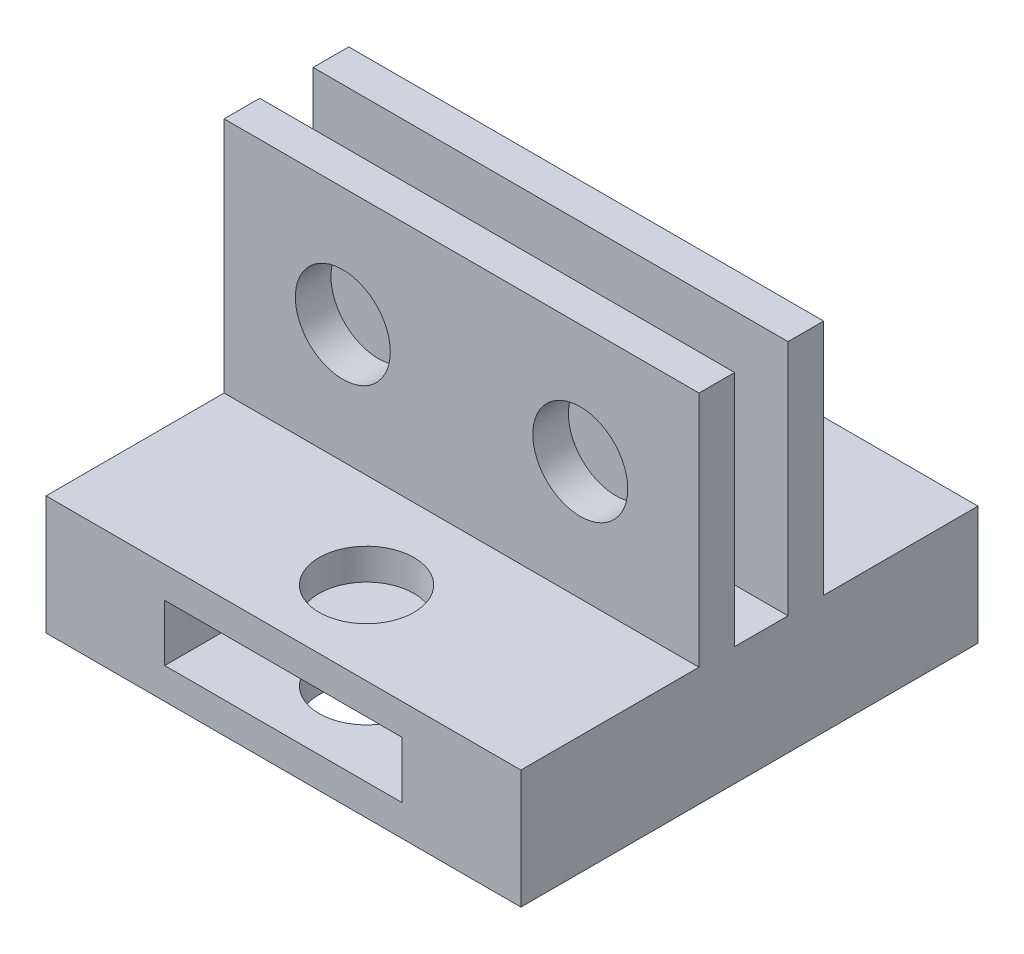
ISO-10303-21;
HEADER;
FILE_DESCRIPTION(('STEP AP214'),'2;1');
FILE_NAME('part.step','',(''),(''),'','','');
FILE_SCHEMA(('AUTOMOTIVE_DESIGN { 1 0 10303 214 1 1 1 1 }'));
ENDSEC;
DATA;
#1=APPLICATION_CONTEXT('core data for automotive mechanical design processes');
#2=APPLICATION_PROTOCOL_DEFINITION('international standard','automotive_design',2000,#1);
#3=PRODUCT_CONTEXT('',#1,'mechanical');
#4=PRODUCT('Part','Part','',(#3));
#5=PRODUCT_RELATED_PRODUCT_CATEGORY('part','',(#4));
#6=PRODUCT_DEFINITION_FORMATION('','',#4);
#7=PRODUCT_DEFINITION_CONTEXT('part definition',#1,'design');
#8=PRODUCT_DEFINITION('design','',#6,#7);
#9=PRODUCT_DEFINITION_SHAPE('','',#8);
#10=(LENGTH_UNIT() NAMED_UNIT(*) SI_UNIT(.MILLI.,.METRE.));
#11=(NAMED_UNIT(*) PLANE_ANGLE_UNIT() SI_UNIT($,.RADIAN.));
#12=(NAMED_UNIT(*) SI_UNIT($,.STERADIAN.) SOLID_ANGLE_UNIT());
#13=UNCERTAINTY_MEASURE_WITH_UNIT(LENGTH_MEASURE(1.E-05),#10,'distance_accuracy_value','');
#14=(GEOMETRIC_REPRESENTATION_CONTEXT(3) GLOBAL_UNCERTAINTY_ASSIGNED_CONTEXT((#13)) GLOBAL_UNIT_ASSIGNED_CONTEXT((#10,
#11,#12)) REPRESENTATION_CONTEXT('',''));
#15=CARTESIAN_POINT('',(0.,0.,0.));
#16=DIRECTION('',(0.,0.,1.));
#17=DIRECTION('',(1.,0.,0.));
#18=AXIS2_PLACEMENT_3D('',#15,#16,#17);
#19=CARTESIAN_POINT('',(0.,-99.9999999999998,3.));
#20=DIRECTION('',(0.,-1.,0.));
#21=DIRECTION('',(0.,0.,-1.));
#22=AXIS2_PLACEMENT_3D('',#19,#20,#21);
#23=PLANE('',#22);
#24=DIRECTION('',(-1.,0.,0.));
#25=VECTOR('',#24,1.);
#26=CARTESIAN_POINT('',(0.,-99.9999999999998,-4.5));
#27=LINE('',#26,#25);
#28=CARTESIAN_POINT('',(-6.34201044239453,-99.9999999999998,-4.5));
#29=VERTEX_POINT('',#28);
#30=CARTESIAN_POINT('',(-46.3420104423945,-99.9999999999998,-4.5));
#31=VERTEX_POINT('',#30);
#32=EDGE_CURVE('E232',#29,#31,#27,.T.);
#33=ORIENTED_EDGE('',*,*,#32,.F.);
#34=DIRECTION('',(0.,0.,-1.));
#35=VECTOR('',#34,1.);
#36=CARTESIAN_POINT('',(-6.34201044239453,-99.9999999999998,3.));
#37=LINE('',#36,#35);
#38=CARTESIAN_POINT('',(-6.34201044239453,-99.9999999999998,-7.5));
#39=VERTEX_POINT('',#38);
#40=EDGE_CURVE('E288',#29,#39,#37,.T.);
#41=ORIENTED_EDGE('',*,*,#40,.T.);
#42=DIRECTION('',(-1.,0.,0.));
#43=VECTOR('',#42,1.);
#44=CARTESIAN_POINT('',(0.,-99.9999999999998,-7.5));
#45=LINE('',#44,#43);
#46=CARTESIAN_POINT('',(-46.3420104423945,-99.9999999999998,-7.5));
#47=VERTEX_POINT('',#46);
#48=EDGE_CURVE('E268',#39,#47,#45,.T.);
#49=ORIENTED_EDGE('',*,*,#48,.T.);
#50=DIRECTION('',(0.,0.,-1.));
#51=VECTOR('',#50,1.);
#52=CARTESIAN_POINT('',(-46.3420104423945,-99.9999999999998,3.));
#53=LINE('',#52,#51);
#54=EDGE_CURVE('E301',#31,#47,#53,.T.);
#55=ORIENTED_EDGE('',*,*,#54,.F.);
#56=EDGE_LOOP('',(#33,#41,#49,#55));
#57=FACE_BOUND('',#56,.T.);
#58=ADVANCED_FACE('F35',(#57),#23,.F.);
#59=CARTESIAN_POINT('',(-46.3420104423946,0.,3.));
#60=DIRECTION('',(1.,0.,0.));
#61=DIRECTION('',(0.,1.,0.));
#62=AXIS2_PLACEMENT_3D('',#59,#60,#61);
#63=PLANE('',#62);
#64=DIRECTION('',(0.,-1.,0.));
#65=VECTOR('',#64,1.);
#66=CARTESIAN_POINT('',(-46.3420104423946,0.,0.));
#67=LINE('',#66,#65);
#68=CARTESIAN_POINT('',(-46.3420104423945,-99.9999999999998,0.));
#69=VERTEX_POINT('',#68);
#70=CARTESIAN_POINT('',(-46.3420104423945,-120.,0.));
#71=VERTEX_POINT('',#70);
#72=EDGE_CURVE('E251',#69,#71,#67,.T.);
#73=ORIENTED_EDGE('',*,*,#72,.T.);
#74=DIRECTION('',(0.,0.,1.));
#75=VECTOR('',#74,1.);
#76=CARTESIAN_POINT('',(-46.3420104423945,-120.,-4.5));
#77=LINE('',#76,#75);
#78=CARTESIAN_POINT('',(-46.3420104423945,-120.,-4.5));
#79=VERTEX_POINT('',#78);
#80=EDGE_CURVE('E242',#79,#71,#77,.T.);
#81=ORIENTED_EDGE('',*,*,#80,.F.);
#82=DIRECTION('',(0.,-1.,0.));
#83=VECTOR('',#82,1.);
#84=CARTESIAN_POINT('',(-46.3420104423946,0.,-4.5));
#85=LINE('',#84,#83);
#86=EDGE_CURVE('E234',#31,#79,#85,.T.);
#87=ORIENTED_EDGE('',*,*,#86,.F.);
#88=ORIENTED_EDGE('',*,*,#54,.T.);
#89=DIRECTION('',(0.,-1.,0.));
#90=VECTOR('',#89,1.);
#91=CARTESIAN_POINT('',(-46.3420104423946,0.,-7.5));
#92=LINE('',#91,#90);
#93=CARTESIAN_POINT('',(-46.3420104423945,-120.,-7.5));
#94=VERTEX_POINT('',#93);
#95=EDGE_CURVE('E271',#47,#94,#92,.T.);
#96=ORIENTED_EDGE('',*,*,#95,.T.);
#97=DIRECTION('',(0.,0.,1.));
#98=VECTOR('',#97,1.);
#99=CARTESIAN_POINT('',(-46.3420104423945,-120.,-20.5));
#100=LINE('',#99,#98);
#101=CARTESIAN_POINT('',(-46.3420104423945,-120.,-20.5));
#102=VERTEX_POINT('',#101);
#103=EDGE_CURVE('E156',#102,#94,#100,.T.);
#104=ORIENTED_EDGE('',*,*,#103,.F.);
#105=DIRECTION('',(0.,-1.,0.));
#106=VECTOR('',#105,1.);
#107=CARTESIAN_POINT('',(-46.3420104423946,0.,-20.5));
#108=LINE('',#107,#106);
#109=CARTESIAN_POINT('',(-46.3420104423945,-130.,-20.5));
#110=VERTEX_POINT('',#109);
#111=EDGE_CURVE('E197',#102,#110,#108,.T.);
#112=ORIENTED_EDGE('',*,*,#111,.T.);
#113=DIRECTION('',(0.,0.,-1.));
#114=VECTOR('',#113,1.);
#115=CARTESIAN_POINT('',(-46.3420104423945,-130.,3.));
#116=LINE('',#115,#114);
#117=CARTESIAN_POINT('',(-46.3420104423945,-130.,18.));
#118=VERTEX_POINT('',#117);
#119=EDGE_CURVE('E164',#118,#110,#116,.T.);
#120=ORIENTED_EDGE('',*,*,#119,.F.);
#121=DIRECTION('',(0.,-1.,0.));
#122=VECTOR('',#121,1.);
#123=CARTESIAN_POINT('',(-46.3420104423946,0.,18.));
#124=LINE('',#123,#122);
#125=CARTESIAN_POINT('',(-46.3420104423945,-120.,18.));
#126=VERTEX_POINT('',#125);
#127=EDGE_CURVE('E160',#126,#118,#124,.T.);
#128=ORIENTED_EDGE('',*,*,#127,.F.);
#129=CARTESIAN_POINT('',(-46.3420104423945,-120.,3.));
#130=VERTEX_POINT('',#129);
#131=EDGE_CURVE('E148',#130,#126,#100,.T.);
#132=ORIENTED_EDGE('',*,*,#131,.F.);
#133=DIRECTION('',(0.,-1.,0.));
#134=VECTOR('',#133,1.);
#135=CARTESIAN_POINT('',(-46.3420104423946,0.,3.));
#136=LINE('',#135,#134);
#137=CARTESIAN_POINT('',(-46.3420104423945,-99.9999999999998,3.));
#138=VERTEX_POINT('',#137);
#139=EDGE_CURVE('E57',#138,#130,#136,.T.);
#140=ORIENTED_EDGE('',*,*,#139,.F.);
#141=EDGE_CURVE('E292',#138,#69,#53,.T.);
#142=ORIENTED_EDGE('',*,*,#141,.T.);
#143=EDGE_LOOP('',(#73,#81,#87,#88,#96,#104,#112,#120,#128,#132,#140,#142));
#144=FACE_BOUND('',#143,.T.);
#145=ADVANCED_FACE('F162',(#144),#63,.F.);
#146=CARTESIAN_POINT('',(-6.34201044239453,0.,3.));
#147=DIRECTION('',(1.,0.,0.));
#148=DIRECTION('',(0.,0.,-1.));
#149=AXIS2_PLACEMENT_3D('',#146,#147,#148);
#150=PLANE('',#149);
#151=DIRECTION('',(0.,-1.,0.));
#152=VECTOR('',#151,1.);
#153=CARTESIAN_POINT('',(-6.34201044239453,0.,3.));
#154=LINE('',#153,#152);
#155=CARTESIAN_POINT('',(-6.34201044239453,-99.9999999999998,3.));
#156=VERTEX_POINT('',#155);
#157=CARTESIAN_POINT('',(-6.34201044239453,-120.,3.));
#158=VERTEX_POINT('',#157);
#159=EDGE_CURVE('E286',#156,#158,#154,.T.);
#160=ORIENTED_EDGE('',*,*,#159,.T.);
#161=DIRECTION('',(0.,0.,1.));
#162=VECTOR('',#161,1.);
#163=CARTESIAN_POINT('',(-6.34201044239453,-120.,-20.5));
#164=LINE('',#163,#162);
#165=CARTESIAN_POINT('',(-6.34201044239453,-120.,18.));
#166=VERTEX_POINT('',#165);
#167=EDGE_CURVE('E219',#158,#166,#164,.T.);
#168=ORIENTED_EDGE('',*,*,#167,.T.);
#169=DIRECTION('',(0.,-1.,0.));
#170=VECTOR('',#169,1.);
#171=CARTESIAN_POINT('',(-6.34201044239453,0.,18.));
#172=LINE('',#171,#170);
#173=CARTESIAN_POINT('',(-6.34201044239453,-130.,18.));
#174=VERTEX_POINT('',#173);
#175=EDGE_CURVE('E173',#166,#174,#172,.T.);
#176=ORIENTED_EDGE('',*,*,#175,.T.);
#177=DIRECTION('',(0.,0.,-1.));
#178=VECTOR('',#177,1.);
#179=CARTESIAN_POINT('',(-6.34201044239453,-130.,3.));
#180=LINE('',#179,#178);
#181=CARTESIAN_POINT('',(-6.34201044239453,-130.,-20.5));
#182=VERTEX_POINT('',#181);
#183=EDGE_CURVE('E298',#174,#182,#180,.T.);
#184=ORIENTED_EDGE('',*,*,#183,.T.);
#185=DIRECTION('',(0.,-1.,0.));
#186=VECTOR('',#185,1.);
#187=CARTESIAN_POINT('',(-6.34201044239453,0.,-20.5));
#188=LINE('',#187,#186);
#189=CARTESIAN_POINT('',(-6.34201044239453,-120.,-20.5));
#190=VERTEX_POINT('',#189);
#191=EDGE_CURVE('E202',#190,#182,#188,.T.);
#192=ORIENTED_EDGE('',*,*,#191,.F.);
#193=CARTESIAN_POINT('',(-6.34201044239453,-120.,-7.5));
#194=VERTEX_POINT('',#193);
#195=EDGE_CURVE('E216',#190,#194,#164,.T.);
#196=ORIENTED_EDGE('',*,*,#195,.T.);
#197=DIRECTION('',(0.,-1.,0.));
#198=VECTOR('',#197,1.);
#199=CARTESIAN_POINT('',(-6.34201044239453,0.,-7.5));
#200=LINE('',#199,#198);
#201=EDGE_CURVE('E274',#39,#194,#200,.T.);
#202=ORIENTED_EDGE('',*,*,#201,.F.);
#203=ORIENTED_EDGE('',*,*,#40,.F.);
#204=DIRECTION('',(0.,-1.,0.));
#205=VECTOR('',#204,1.);
#206=CARTESIAN_POINT('',(-6.34201044239453,0.,-4.5));
#207=LINE('',#206,#205);
#208=CARTESIAN_POINT('',(-6.34201044239453,-120.,-4.5));
#209=VERTEX_POINT('',#208);
#210=EDGE_CURVE('E239',#29,#209,#207,.T.);
#211=ORIENTED_EDGE('',*,*,#210,.T.);
#212=DIRECTION('',(0.,0.,1.));
#213=VECTOR('',#212,1.);
#214=CARTESIAN_POINT('',(-6.34201044239453,-120.,-4.5));
#215=LINE('',#214,#213);
#216=CARTESIAN_POINT('',(-6.34201044239453,-120.,0.));
#217=VERTEX_POINT('',#216);
#218=EDGE_CURVE('E258',#209,#217,#215,.T.);
#219=ORIENTED_EDGE('',*,*,#218,.T.);
#220=DIRECTION('',(0.,-1.,0.));
#221=VECTOR('',#220,1.);
#222=CARTESIAN_POINT('',(-6.34201044239453,0.,0.));
#223=LINE('',#222,#221);
#224=CARTESIAN_POINT('',(-6.34201044239453,-99.9999999999998,0.));
#225=VERTEX_POINT('',#224);
#226=EDGE_CURVE('E229',#225,#217,#223,.T.);
#227=ORIENTED_EDGE('',*,*,#226,.F.);
#228=EDGE_CURVE('E295',#156,#225,#37,.T.);
#229=ORIENTED_EDGE('',*,*,#228,.F.);
#230=EDGE_LOOP('',(#160,#168,#176,#184,#192,#196,#202,#203,#211,#219,#227,#229));
#231=FACE_BOUND('',#230,.T.);
#232=ADVANCED_FACE('F350',(#231),#150,.T.);
#233=CARTESIAN_POINT('',(-16.3420104423945,-110.,3.));
#234=DIRECTION('',(0.,0.,-1.));
#235=DIRECTION('',(-1.,0.,0.));
#236=AXIS2_PLACEMENT_3D('',#233,#234,#235);
#237=CYLINDRICAL_SURFACE('',#236,4.);
#238=CARTESIAN_POINT('',(-16.3420104423945,-110.,-7.5));
#239=DIRECTION('',(0.,0.,1.));
#240=DIRECTION('',(1.,0.,0.));
#241=AXIS2_PLACEMENT_3D('',#238,#239,#240);
#242=CIRCLE('',#241,4.);
#243=CARTESIAN_POINT('',(-12.3420104423945,-110.,-7.5));
#244=VERTEX_POINT('',#243);
#245=EDGE_CURVE('E265',#244,#244,#242,.T.);
#246=ORIENTED_EDGE('',*,*,#245,.F.);
#247=EDGE_LOOP('',(#246));
#248=FACE_BOUND('',#247,.T.);
#249=CARTESIAN_POINT('',(-16.3420104423945,-110.,-4.5));
#250=DIRECTION('',(0.,0.,1.));
#251=DIRECTION('',(1.,0.,0.));
#252=AXIS2_PLACEMENT_3D('',#249,#250,#251);
#253=CIRCLE('',#252,4.);
#254=CARTESIAN_POINT('',(-12.3420104423945,-110.,-4.5));
#255=VERTEX_POINT('',#254);
#256=EDGE_CURVE('E228',#255,#255,#253,.T.);
#257=ORIENTED_EDGE('',*,*,#256,.T.);
#258=EDGE_LOOP('',(#257));
#259=FACE_BOUND('',#258,.T.);
#260=ADVANCED_FACE('F380',(#248,#259),#237,.F.);
#261=CARTESIAN_POINT('',(-36.3420104423945,-110.,3.));
#262=DIRECTION('',(0.,0.,-1.));
#263=DIRECTION('',(-1.,0.,0.));
#264=AXIS2_PLACEMENT_3D('',#261,#262,#263);
#265=CYLINDRICAL_SURFACE('',#264,4.00000000000001);
#266=CARTESIAN_POINT('',(-36.3420104423945,-110.,-7.5));
#267=DIRECTION('',(0.,0.,1.));
#268=DIRECTION('',(1.,0.,0.));
#269=AXIS2_PLACEMENT_3D('',#266,#267,#268);
#270=CIRCLE('',#269,4.00000000000001);
#271=CARTESIAN_POINT('',(-32.3420104423945,-110.,-7.5));
#272=VERTEX_POINT('',#271);
#273=EDGE_CURVE('E261',#272,#272,#270,.T.);
#274=ORIENTED_EDGE('',*,*,#273,.F.);
#275=EDGE_LOOP('',(#274));
#276=FACE_BOUND('',#275,.T.);
#277=CARTESIAN_POINT('',(-36.3420104423945,-110.,-4.5));
#278=DIRECTION('',(0.,0.,1.));
#279=DIRECTION('',(1.,0.,0.));
#280=AXIS2_PLACEMENT_3D('',#277,#278,#279);
#281=CIRCLE('',#280,4.00000000000001);
#282=CARTESIAN_POINT('',(-32.3420104423945,-110.,-4.5));
#283=VERTEX_POINT('',#282);
#284=EDGE_CURVE('E225',#283,#283,#281,.T.);
#285=ORIENTED_EDGE('',*,*,#284,.T.);
#286=EDGE_LOOP('',(#285));
#287=FACE_BOUND('',#286,.T.);
#288=ADVANCED_FACE('F376',(#276,#287),#265,.F.);
#289=ORIENTED_EDGE('',*,*,#228,.T.);
#290=DIRECTION('',(-1.,0.,0.));
#291=VECTOR('',#290,1.);
#292=CARTESIAN_POINT('',(0.,-99.9999999999998,0.));
#293=LINE('',#292,#291);
#294=EDGE_CURVE('E248',#225,#69,#293,.T.);
#295=ORIENTED_EDGE('',*,*,#294,.T.);
#296=ORIENTED_EDGE('',*,*,#141,.F.);
#297=DIRECTION('',(-1.,0.,0.));
#298=VECTOR('',#297,1.);
#299=CARTESIAN_POINT('',(0.,-99.9999999999998,3.));
#300=LINE('',#299,#298);
#301=EDGE_CURVE('E283',#156,#138,#300,.T.);
#302=ORIENTED_EDGE('',*,*,#301,.F.);
#303=EDGE_LOOP('',(#289,#295,#296,#302));
#304=FACE_BOUND('',#303,.T.);
#305=ADVANCED_FACE('F331',(#304),#23,.F.);
#306=CARTESIAN_POINT('',(0.,-130.,3.));
#307=DIRECTION('',(0.,-1.,0.));
#308=DIRECTION('',(0.,0.,-1.));
#309=AXIS2_PLACEMENT_3D('',#306,#307,#308);
#310=PLANE('',#309);
#311=CARTESIAN_POINT('',(-26.3420104423945,-130.,11.));
#312=DIRECTION('',(0.,-1.,0.));
#313=DIRECTION('',(0.,0.,-1.));
#314=AXIS2_PLACEMENT_3D('',#311,#312,#313);
#315=CIRCLE('',#314,4.);
#316=CARTESIAN_POINT('',(-26.3420104423945,-130.,7.));
#317=VERTEX_POINT('',#316);
#318=EDGE_CURVE('E311',#317,#317,#315,.T.);
#319=ORIENTED_EDGE('',*,*,#318,.F.);
#320=EDGE_LOOP('',(#319));
#321=FACE_BOUND('',#320,.T.);
#322=CARTESIAN_POINT('',(-26.3420104423945,-130.,-13.5));
#323=DIRECTION('',(0.,-1.,0.));
#324=DIRECTION('',(0.,0.,-1.));
#325=AXIS2_PLACEMENT_3D('',#322,#323,#324);
#326=CIRCLE('',#325,4.);
#327=CARTESIAN_POINT('',(-26.3420104423945,-130.,-17.5));
#328=VERTEX_POINT('',#327);
#329=EDGE_CURVE('E321',#328,#328,#326,.T.);
#330=ORIENTED_EDGE('',*,*,#329,.F.);
#331=EDGE_LOOP('',(#330));
#332=FACE_BOUND('',#331,.T.);
#333=ORIENTED_EDGE('',*,*,#119,.T.);
#334=DIRECTION('',(-1.,0.,0.));
#335=VECTOR('',#334,1.);
#336=CARTESIAN_POINT('',(0.,-130.,-20.5));
#337=LINE('',#336,#335);
#338=EDGE_CURVE('E199',#182,#110,#337,.T.);
#339=ORIENTED_EDGE('',*,*,#338,.F.);
#340=ORIENTED_EDGE('',*,*,#183,.F.);
#341=DIRECTION('',(-1.,0.,0.));
#342=VECTOR('',#341,1.);
#343=CARTESIAN_POINT('',(0.,-130.,18.));
#344=LINE('',#343,#342);
#345=EDGE_CURVE('E168',#174,#118,#344,.T.);
#346=ORIENTED_EDGE('',*,*,#345,.T.);
#347=EDGE_LOOP('',(#333,#339,#340,#346));
#348=FACE_BOUND('',#347,.T.);
#349=ADVANCED_FACE('F327',(#321,#332,#348),#310,.T.);
#350=CARTESIAN_POINT('',(-16.3420104423945,-110.,0.));
#351=DIRECTION('',(0.,0.,1.));
#352=DIRECTION('',(1.,0.,0.));
#353=AXIS2_PLACEMENT_3D('',#350,#351,#352);
#354=CIRCLE('',#353,4.);
#355=CARTESIAN_POINT('',(-12.3420104423945,-110.,0.));
#356=VERTEX_POINT('',#355);
#357=EDGE_CURVE('E245',#356,#356,#354,.T.);
#358=ORIENTED_EDGE('',*,*,#357,.F.);
#359=EDGE_LOOP('',(#358));
#360=FACE_BOUND('',#359,.T.);
#361=CARTESIAN_POINT('',(-16.3420104423945,-110.,3.));
#362=DIRECTION('',(0.,0.,1.));
#363=DIRECTION('',(1.,0.,0.));
#364=AXIS2_PLACEMENT_3D('',#361,#362,#363);
#365=CIRCLE('',#364,4.);
#366=CARTESIAN_POINT('',(-12.3420104423945,-110.,3.));
#367=VERTEX_POINT('',#366);
#368=EDGE_CURVE('E280',#367,#367,#365,.T.);
#369=ORIENTED_EDGE('',*,*,#368,.T.);
#370=EDGE_LOOP('',(#369));
#371=FACE_BOUND('',#370,.T.);
#372=ADVANCED_FACE('F330',(#360,#371),#237,.F.);
#373=CARTESIAN_POINT('',(-36.3420104423945,-110.,0.));
#374=DIRECTION('',(0.,0.,1.));
#375=DIRECTION('',(1.,0.,0.));
#376=AXIS2_PLACEMENT_3D('',#373,#374,#375);
#377=CIRCLE('',#376,4.00000000000001);
#378=CARTESIAN_POINT('',(-32.3420104423945,-110.,0.));
#379=VERTEX_POINT('',#378);
#380=EDGE_CURVE('E224',#379,#379,#377,.T.);
#381=ORIENTED_EDGE('',*,*,#380,.F.);
#382=EDGE_LOOP('',(#381));
#383=FACE_BOUND('',#382,.T.);
#384=CARTESIAN_POINT('',(-36.3420104423945,-110.,3.));
#385=DIRECTION('',(0.,0.,1.));
#386=DIRECTION('',(1.,0.,0.));
#387=AXIS2_PLACEMENT_3D('',#384,#385,#386);
#388=CIRCLE('',#387,4.00000000000001);
#389=CARTESIAN_POINT('',(-32.3420104423945,-110.,3.));
#390=VERTEX_POINT('',#389);
#391=EDGE_CURVE('E277',#390,#390,#388,.T.);
#392=ORIENTED_EDGE('',*,*,#391,.T.);
#393=EDGE_LOOP('',(#392));
#394=FACE_BOUND('',#393,.T.);
#395=ADVANCED_FACE('F37',(#383,#394),#265,.F.);
#396=CARTESIAN_POINT('',(0.,0.,3.));
#397=DIRECTION('',(0.,0.,1.));
#398=DIRECTION('',(1.,0.,0.));
#399=AXIS2_PLACEMENT_3D('',#396,#397,#398);
#400=PLANE('',#399);
#401=DIRECTION('',(-1.,0.,0.));
#402=VECTOR('',#401,1.);
#403=CARTESIAN_POINT('',(0.,-120.,3.));
#404=LINE('',#403,#402);
#405=EDGE_CURVE('E52',#158,#130,#404,.T.);
#406=ORIENTED_EDGE('',*,*,#405,.F.);
#407=ORIENTED_EDGE('',*,*,#159,.F.);
#408=ORIENTED_EDGE('',*,*,#301,.T.);
#409=ORIENTED_EDGE('',*,*,#139,.T.);
#410=EDGE_LOOP('',(#406,#407,#408,#409));
#411=FACE_BOUND('',#410,.T.);
#412=ORIENTED_EDGE('',*,*,#391,.F.);
#413=EDGE_LOOP('',(#412));
#414=FACE_BOUND('',#413,.T.);
#415=ORIENTED_EDGE('',*,*,#368,.F.);
#416=EDGE_LOOP('',(#415));
#417=FACE_BOUND('',#416,.T.);
#418=ADVANCED_FACE('F353',(#411,#414,#417),#400,.T.);
#419=CARTESIAN_POINT('',(0.,0.,-7.5));
#420=DIRECTION('',(0.,0.,1.));
#421=DIRECTION('',(1.,0.,0.));
#422=AXIS2_PLACEMENT_3D('',#419,#420,#421);
#423=PLANE('',#422);
#424=ORIENTED_EDGE('',*,*,#273,.T.);
#425=EDGE_LOOP('',(#424));
#426=FACE_BOUND('',#425,.T.);
#427=ORIENTED_EDGE('',*,*,#245,.T.);
#428=EDGE_LOOP('',(#427));
#429=FACE_BOUND('',#428,.T.);
#430=ORIENTED_EDGE('',*,*,#201,.T.);
#431=DIRECTION('',(-1.,0.,0.));
#432=VECTOR('',#431,1.);
#433=CARTESIAN_POINT('',(0.,-120.,-7.5));
#434=LINE('',#433,#432);
#435=EDGE_CURVE('E218',#194,#94,#434,.T.);
#436=ORIENTED_EDGE('',*,*,#435,.T.);
#437=ORIENTED_EDGE('',*,*,#95,.F.);
#438=ORIENTED_EDGE('',*,*,#48,.F.);
#439=EDGE_LOOP('',(#430,#436,#437,#438));
#440=FACE_BOUND('',#439,.T.);
#441=ADVANCED_FACE('F345',(#426,#429,#440),#423,.F.);
#442=CARTESIAN_POINT('',(0.,-120.,-4.5));
#443=DIRECTION('',(0.,1.,0.));
#444=DIRECTION('',(0.,0.,1.));
#445=AXIS2_PLACEMENT_3D('',#442,#443,#444);
#446=PLANE('',#445);
#447=DIRECTION('',(-1.,0.,0.));
#448=VECTOR('',#447,1.);
#449=CARTESIAN_POINT('',(0.,-120.,0.));
#450=LINE('',#449,#448);
#451=EDGE_CURVE('E253',#217,#71,#450,.T.);
#452=ORIENTED_EDGE('',*,*,#451,.F.);
#453=ORIENTED_EDGE('',*,*,#218,.F.);
#454=DIRECTION('',(-1.,0.,0.));
#455=VECTOR('',#454,1.);
#456=CARTESIAN_POINT('',(0.,-120.,-4.5));
#457=LINE('',#456,#455);
#458=EDGE_CURVE('E237',#209,#79,#457,.T.);
#459=ORIENTED_EDGE('',*,*,#458,.T.);
#460=ORIENTED_EDGE('',*,*,#80,.T.);
#461=EDGE_LOOP('',(#452,#453,#459,#460));
#462=FACE_BOUND('',#461,.T.);
#463=ADVANCED_FACE('F363',(#462),#446,.T.);
#464=CARTESIAN_POINT('',(0.,0.,-4.5));
#465=DIRECTION('',(0.,0.,1.));
#466=DIRECTION('',(1.,0.,0.));
#467=AXIS2_PLACEMENT_3D('',#464,#465,#466);
#468=PLANE('',#467);
#469=ORIENTED_EDGE('',*,*,#284,.F.);
#470=EDGE_LOOP('',(#469));
#471=FACE_BOUND('',#470,.T.);
#472=ORIENTED_EDGE('',*,*,#256,.F.);
#473=EDGE_LOOP('',(#472));
#474=FACE_BOUND('',#473,.T.);
#475=ORIENTED_EDGE('',*,*,#32,.T.);
#476=ORIENTED_EDGE('',*,*,#86,.T.);
#477=ORIENTED_EDGE('',*,*,#458,.F.);
#478=ORIENTED_EDGE('',*,*,#210,.F.);
#479=EDGE_LOOP('',(#475,#476,#477,#478));
#480=FACE_BOUND('',#479,.T.);
#481=ADVANCED_FACE('F365',(#471,#474,#480),#468,.T.);
#482=CARTESIAN_POINT('',(0.,0.,0.));
#483=DIRECTION('',(0.,0.,1.));
#484=DIRECTION('',(1.,0.,0.));
#485=AXIS2_PLACEMENT_3D('',#482,#483,#484);
#486=PLANE('',#485);
#487=ORIENTED_EDGE('',*,*,#380,.T.);
#488=EDGE_LOOP('',(#487));
#489=FACE_BOUND('',#488,.T.);
#490=ORIENTED_EDGE('',*,*,#357,.T.);
#491=EDGE_LOOP('',(#490));
#492=FACE_BOUND('',#491,.T.);
#493=ORIENTED_EDGE('',*,*,#294,.F.);
#494=ORIENTED_EDGE('',*,*,#226,.T.);
#495=ORIENTED_EDGE('',*,*,#451,.T.);
#496=ORIENTED_EDGE('',*,*,#72,.F.);
#497=EDGE_LOOP('',(#493,#494,#495,#496));
#498=FACE_BOUND('',#497,.T.);
#499=ADVANCED_FACE('F360',(#489,#492,#498),#486,.F.);
#500=CARTESIAN_POINT('',(0.,-120.,-20.5));
#501=DIRECTION('',(0.,1.,0.));
#502=DIRECTION('',(0.,0.,1.));
#503=AXIS2_PLACEMENT_3D('',#500,#501,#502);
#504=PLANE('',#503);
#505=CARTESIAN_POINT('',(-26.3420104423945,-120.,-13.5));
#506=DIRECTION('',(0.,-1.,0.));
#507=DIRECTION('',(0.,0.,-1.));
#508=AXIS2_PLACEMENT_3D('',#505,#506,#507);
#509=CIRCLE('',#508,4.);
#510=CARTESIAN_POINT('',(-26.3420104423945,-120.,-17.5));
#511=VERTEX_POINT('',#510);
#512=EDGE_CURVE('E316',#511,#511,#509,.T.);
#513=ORIENTED_EDGE('',*,*,#512,.T.);
#514=EDGE_LOOP('',(#513));
#515=FACE_BOUND('',#514,.T.);
#516=ORIENTED_EDGE('',*,*,#435,.F.);
#517=ORIENTED_EDGE('',*,*,#195,.F.);
#518=DIRECTION('',(-1.,0.,0.));
#519=VECTOR('',#518,1.);
#520=CARTESIAN_POINT('',(0.,-120.,-20.5));
#521=LINE('',#520,#519);
#522=EDGE_CURVE('E194',#190,#102,#521,.T.);
#523=ORIENTED_EDGE('',*,*,#522,.T.);
#524=ORIENTED_EDGE('',*,*,#103,.T.);
#525=EDGE_LOOP('',(#516,#517,#523,#524));
#526=FACE_BOUND('',#525,.T.);
#527=ADVANCED_FACE('F343',(#515,#526),#504,.T.);
#528=CARTESIAN_POINT('',(0.,0.,-20.5));
#529=DIRECTION('',(0.,0.,1.));
#530=DIRECTION('',(1.,0.,0.));
#531=AXIS2_PLACEMENT_3D('',#528,#529,#530);
#532=PLANE('',#531);
#533=ORIENTED_EDGE('',*,*,#522,.F.);
#534=ORIENTED_EDGE('',*,*,#191,.T.);
#535=ORIENTED_EDGE('',*,*,#338,.T.);
#536=ORIENTED_EDGE('',*,*,#111,.F.);
#537=EDGE_LOOP('',(#533,#534,#535,#536));
#538=FACE_BOUND('',#537,.T.);
#539=DIRECTION('',(1.,0.,0.));
#540=VECTOR('',#539,1.);
#541=CARTESIAN_POINT('',(0.,-122.62,-20.5));
#542=LINE('',#541,#540);
#543=CARTESIAN_POINT('',(-36.3420104423945,-122.62,-20.5));
#544=VERTEX_POINT('',#543);
#545=CARTESIAN_POINT('',(-16.3420104423945,-122.62,-20.5));
#546=VERTEX_POINT('',#545);
#547=EDGE_CURVE('E205',#544,#546,#542,.T.);
#548=ORIENTED_EDGE('',*,*,#547,.F.);
#549=DIRECTION('',(0.,-1.,0.));
#550=VECTOR('',#549,1.);
#551=CARTESIAN_POINT('',(-36.3420104423945,0.,-20.5));
#552=LINE('',#551,#550);
#553=CARTESIAN_POINT('',(-36.3420104423945,-127.38,-20.5));
#554=VERTEX_POINT('',#553);
#555=EDGE_CURVE('E157',#544,#554,#552,.T.);
#556=ORIENTED_EDGE('',*,*,#555,.T.);
#557=DIRECTION('',(1.,0.,0.));
#558=VECTOR('',#557,1.);
#559=CARTESIAN_POINT('',(0.,-127.38,-20.5));
#560=LINE('',#559,#558);
#561=CARTESIAN_POINT('',(-16.3420104423945,-127.38,-20.5));
#562=VERTEX_POINT('',#561);
#563=EDGE_CURVE('E211',#554,#562,#560,.T.);
#564=ORIENTED_EDGE('',*,*,#563,.T.);
#565=DIRECTION('',(0.,-1.,0.));
#566=VECTOR('',#565,1.);
#567=CARTESIAN_POINT('',(-16.3420104423945,0.,-20.5));
#568=LINE('',#567,#566);
#569=EDGE_CURVE('E208',#546,#562,#568,.T.);
#570=ORIENTED_EDGE('',*,*,#569,.F.);
#571=EDGE_LOOP('',(#548,#556,#564,#570));
#572=FACE_BOUND('',#571,.T.);
#573=ADVANCED_FACE('F338',(#538,#572),#532,.F.);
#574=CARTESIAN_POINT('',(-26.3420104423945,-120.,11.));
#575=DIRECTION('',(0.,-1.,0.));
#576=DIRECTION('',(0.,0.,-1.));
#577=AXIS2_PLACEMENT_3D('',#574,#575,#576);
#578=CIRCLE('',#577,4.);
#579=CARTESIAN_POINT('',(-26.3420104423945,-120.,7.));
#580=VERTEX_POINT('',#579);
#581=EDGE_CURVE('E306',#580,#580,#578,.T.);
#582=ORIENTED_EDGE('',*,*,#581,.T.);
#583=EDGE_LOOP('',(#582));
#584=FACE_BOUND('',#583,.T.);
#585=ORIENTED_EDGE('',*,*,#167,.F.);
#586=ORIENTED_EDGE('',*,*,#405,.T.);
#587=ORIENTED_EDGE('',*,*,#131,.T.);
#588=DIRECTION('',(-1.,0.,0.));
#589=VECTOR('',#588,1.);
#590=CARTESIAN_POINT('',(0.,-120.,18.));
#591=LINE('',#590,#589);
#592=EDGE_CURVE('E153',#166,#126,#591,.T.);
#593=ORIENTED_EDGE('',*,*,#592,.F.);
#594=EDGE_LOOP('',(#585,#586,#587,#593));
#595=FACE_BOUND('',#594,.T.);
#596=ADVANCED_FACE('F151',(#584,#595),#504,.T.);
#597=CARTESIAN_POINT('',(0.,0.,18.));
#598=DIRECTION('',(0.,0.,1.));
#599=DIRECTION('',(1.,0.,0.));
#600=AXIS2_PLACEMENT_3D('',#597,#598,#599);
#601=PLANE('',#600);
#602=ORIENTED_EDGE('',*,*,#592,.T.);
#603=ORIENTED_EDGE('',*,*,#127,.T.);
#604=ORIENTED_EDGE('',*,*,#345,.F.);
#605=ORIENTED_EDGE('',*,*,#175,.F.);
#606=EDGE_LOOP('',(#602,#603,#604,#605));
#607=FACE_BOUND('',#606,.T.);
#608=DIRECTION('',(1.,0.,0.));
#609=VECTOR('',#608,1.);
#610=CARTESIAN_POINT('',(0.,-122.62,18.));
#611=LINE('',#610,#609);
#612=CARTESIAN_POINT('',(-36.3420104423945,-122.62,18.));
#613=VERTEX_POINT('',#612);
#614=CARTESIAN_POINT('',(-16.3420104423945,-122.62,18.));
#615=VERTEX_POINT('',#614);
#616=EDGE_CURVE('E182',#613,#615,#611,.T.);
#617=ORIENTED_EDGE('',*,*,#616,.T.);
#618=DIRECTION('',(0.,-1.,0.));
#619=VECTOR('',#618,1.);
#620=CARTESIAN_POINT('',(-16.3420104423945,0.,18.));
#621=LINE('',#620,#619);
#622=CARTESIAN_POINT('',(-16.3420104423945,-127.38,18.));
#623=VERTEX_POINT('',#622);
#624=EDGE_CURVE('E185',#615,#623,#621,.T.);
#625=ORIENTED_EDGE('',*,*,#624,.T.);
#626=DIRECTION('',(1.,0.,0.));
#627=VECTOR('',#626,1.);
#628=CARTESIAN_POINT('',(0.,-127.38,18.));
#629=LINE('',#628,#627);
#630=CARTESIAN_POINT('',(-36.3420104423945,-127.38,18.));
#631=VERTEX_POINT('',#630);
#632=EDGE_CURVE('E188',#631,#623,#629,.T.);
#633=ORIENTED_EDGE('',*,*,#632,.F.);
#634=DIRECTION('',(0.,-1.,0.));
#635=VECTOR('',#634,1.);
#636=CARTESIAN_POINT('',(-36.3420104423945,0.,18.));
#637=LINE('',#636,#635);
#638=EDGE_CURVE('E191',#613,#631,#637,.T.);
#639=ORIENTED_EDGE('',*,*,#638,.F.);
#640=EDGE_LOOP('',(#617,#625,#633,#639));
#641=FACE_BOUND('',#640,.T.);
#642=ADVANCED_FACE('F170',(#607,#641),#601,.T.);
#643=CARTESIAN_POINT('',(-16.3420104423945,0.,3.));
#644=DIRECTION('',(1.,0.,0.));
#645=DIRECTION('',(0.,0.,-1.));
#646=AXIS2_PLACEMENT_3D('',#643,#644,#645);
#647=PLANE('',#646);
#648=DIRECTION('',(0.,0.,-1.));
#649=VECTOR('',#648,1.);
#650=CARTESIAN_POINT('',(-16.3420104423945,-122.62,3.));
#651=LINE('',#650,#649);
#652=EDGE_CURVE('E11',#615,#546,#651,.T.);
#653=ORIENTED_EDGE('',*,*,#652,.T.);
#654=ORIENTED_EDGE('',*,*,#569,.T.);
#655=DIRECTION('',(0.,0.,-1.));
#656=VECTOR('',#655,1.);
#657=CARTESIAN_POINT('',(-16.3420104423945,-127.38,3.));
#658=LINE('',#657,#656);
#659=EDGE_CURVE('E44',#623,#562,#658,.T.);
#660=ORIENTED_EDGE('',*,*,#659,.F.);
#661=ORIENTED_EDGE('',*,*,#624,.F.);
#662=EDGE_LOOP('',(#653,#654,#660,#661));
#663=FACE_BOUND('',#662,.T.);
#664=ADVANCED_FACE('F429',(#663),#647,.F.);
#665=CARTESIAN_POINT('',(0.,-127.38,3.));
#666=DIRECTION('',(0.,1.,0.));
#667=DIRECTION('',(0.,0.,1.));
#668=AXIS2_PLACEMENT_3D('',#665,#666,#667);
#669=PLANE('',#668);
#670=CARTESIAN_POINT('',(-26.3420104423945,-127.38,11.));
#671=DIRECTION('',(0.,1.,0.));
#672=DIRECTION('',(0.,0.,1.));
#673=AXIS2_PLACEMENT_3D('',#670,#671,#672);
#674=CIRCLE('',#673,4.);
#675=CARTESIAN_POINT('',(-26.3420104423945,-127.38,15.));
#676=VERTEX_POINT('',#675);
#677=EDGE_CURVE('E174',#676,#676,#674,.T.);
#678=ORIENTED_EDGE('',*,*,#677,.F.);
#679=EDGE_LOOP('',(#678));
#680=FACE_BOUND('',#679,.T.);
#681=CARTESIAN_POINT('',(-26.3420104423945,-127.38,-13.5));
#682=DIRECTION('',(0.,1.,0.));
#683=DIRECTION('',(0.,0.,1.));
#684=AXIS2_PLACEMENT_3D('',#681,#682,#683);
#685=CIRCLE('',#684,4.);
#686=CARTESIAN_POINT('',(-26.3420104423945,-127.38,-9.50000000000001));
#687=VERTEX_POINT('',#686);
#688=EDGE_CURVE('E305',#687,#687,#685,.T.);
#689=ORIENTED_EDGE('',*,*,#688,.F.);
#690=EDGE_LOOP('',(#689));
#691=FACE_BOUND('',#690,.T.);
#692=ORIENTED_EDGE('',*,*,#659,.T.);
#693=ORIENTED_EDGE('',*,*,#563,.F.);
#694=DIRECTION('',(0.,0.,-1.));
#695=VECTOR('',#694,1.);
#696=CARTESIAN_POINT('',(-36.3420104423945,-127.38,3.));
#697=LINE('',#696,#695);
#698=EDGE_CURVE('E291',#631,#554,#697,.T.);
#699=ORIENTED_EDGE('',*,*,#698,.F.);
#700=ORIENTED_EDGE('',*,*,#632,.T.);
#701=EDGE_LOOP('',(#692,#693,#699,#700));
#702=FACE_BOUND('',#701,.T.);
#703=ADVANCED_FACE('F425',(#680,#691,#702),#669,.T.);
#704=CARTESIAN_POINT('',(-36.3420104423945,0.,3.));
#705=DIRECTION('',(1.,0.,0.));
#706=DIRECTION('',(0.,0.,-1.));
#707=AXIS2_PLACEMENT_3D('',#704,#705,#706);
#708=PLANE('',#707);
#709=ORIENTED_EDGE('',*,*,#698,.T.);
#710=ORIENTED_EDGE('',*,*,#555,.F.);
#711=DIRECTION('',(0.,0.,-1.));
#712=VECTOR('',#711,1.);
#713=CARTESIAN_POINT('',(-36.3420104423945,-122.62,3.));
#714=LINE('',#713,#712);
#715=EDGE_CURVE('E289',#613,#544,#714,.T.);
#716=ORIENTED_EDGE('',*,*,#715,.F.);
#717=ORIENTED_EDGE('',*,*,#638,.T.);
#718=EDGE_LOOP('',(#709,#710,#716,#717));
#719=FACE_BOUND('',#718,.T.);
#720=ADVANCED_FACE('F421',(#719),#708,.T.);
#721=CARTESIAN_POINT('',(0.,-122.62,3.));
#722=DIRECTION('',(0.,1.,0.));
#723=DIRECTION('',(-1.,0.,0.));
#724=AXIS2_PLACEMENT_3D('',#721,#722,#723);
#725=PLANE('',#724);
#726=CARTESIAN_POINT('',(-26.3420104423945,-122.62,11.));
#727=DIRECTION('',(0.,1.,0.));
#728=DIRECTION('',(-1.,0.,0.));
#729=AXIS2_PLACEMENT_3D('',#726,#727,#728);
#730=CIRCLE('',#729,4.);
#731=CARTESIAN_POINT('',(-30.3420104423945,-122.62,11.));
#732=VERTEX_POINT('',#731);
#733=EDGE_CURVE('E39',#732,#732,#730,.T.);
#734=ORIENTED_EDGE('',*,*,#733,.T.);
#735=EDGE_LOOP('',(#734));
#736=FACE_BOUND('',#735,.T.);
#737=CARTESIAN_POINT('',(-26.3420104423945,-122.62,-13.5));
#738=DIRECTION('',(0.,1.,0.));
#739=DIRECTION('',(-1.,0.,0.));
#740=AXIS2_PLACEMENT_3D('',#737,#738,#739);
#741=CIRCLE('',#740,4.);
#742=CARTESIAN_POINT('',(-30.3420104423945,-122.62,-13.5));
#743=VERTEX_POINT('',#742);
#744=EDGE_CURVE('E303',#743,#743,#741,.T.);
#745=ORIENTED_EDGE('',*,*,#744,.T.);
#746=EDGE_LOOP('',(#745));
#747=FACE_BOUND('',#746,.T.);
#748=ORIENTED_EDGE('',*,*,#715,.T.);
#749=ORIENTED_EDGE('',*,*,#547,.T.);
#750=ORIENTED_EDGE('',*,*,#652,.F.);
#751=ORIENTED_EDGE('',*,*,#616,.F.);
#752=EDGE_LOOP('',(#748,#749,#750,#751));
#753=FACE_BOUND('',#752,.T.);
#754=ADVANCED_FACE('F424',(#736,#747,#753),#725,.F.);
#755=CARTESIAN_POINT('',(-26.3420104423945,-120.,-13.5));
#756=DIRECTION('',(0.,-1.,0.));
#757=DIRECTION('',(0.,0.,-1.));
#758=AXIS2_PLACEMENT_3D('',#755,#756,#757);
#759=CYLINDRICAL_SURFACE('',#758,4.);
#760=ORIENTED_EDGE('',*,*,#512,.F.);
#761=EDGE_LOOP('',(#760));
#762=FACE_BOUND('',#761,.T.);
#763=ORIENTED_EDGE('',*,*,#744,.F.);
#764=EDGE_LOOP('',(#763));
#765=FACE_BOUND('',#764,.T.);
#766=ADVANCED_FACE('F436',(#762,#765),#759,.F.);
#767=CARTESIAN_POINT('',(-26.3420104423945,-120.,11.));
#768=DIRECTION('',(0.,-1.,0.));
#769=DIRECTION('',(0.,0.,-1.));
#770=AXIS2_PLACEMENT_3D('',#767,#768,#769);
#771=CYLINDRICAL_SURFACE('',#770,4.);
#772=ORIENTED_EDGE('',*,*,#581,.F.);
#773=EDGE_LOOP('',(#772));
#774=FACE_BOUND('',#773,.T.);
#775=ORIENTED_EDGE('',*,*,#733,.F.);
#776=EDGE_LOOP('',(#775));
#777=FACE_BOUND('',#776,.T.);
#778=ADVANCED_FACE('F596',(#774,#777),#771,.F.);
#779=ORIENTED_EDGE('',*,*,#688,.T.);
#780=EDGE_LOOP('',(#779));
#781=FACE_BOUND('',#780,.T.);
#782=ORIENTED_EDGE('',*,*,#329,.T.);
#783=EDGE_LOOP('',(#782));
#784=FACE_BOUND('',#783,.T.);
#785=ADVANCED_FACE('F325',(#781,#784),#759,.F.);
#786=ORIENTED_EDGE('',*,*,#677,.T.);
#787=EDGE_LOOP('',(#786));
#788=FACE_BOUND('',#787,.T.);
#789=ORIENTED_EDGE('',*,*,#318,.T.);
#790=EDGE_LOOP('',(#789));
#791=FACE_BOUND('',#790,.T.);
#792=ADVANCED_FACE('F607',(#788,#791),#771,.F.);
#793=CLOSED_SHELL('',(#58,#145,#232,#260,#288,#305,#349,#372,#395,#418,#441,#463,#481,#499,#527,
#573,#596,#642,#664,#703,#720,#754,#766,#778,#785,#792));
#794=MANIFOLD_SOLID_BREP('B2',#793);
#795=ADVANCED_BREP_SHAPE_REPRESENTATION('',(#18,#794),#14);
#796=SHAPE_DEFINITION_REPRESENTATION(#9,#795);
ENDSEC;
END-ISO-10303-21;
